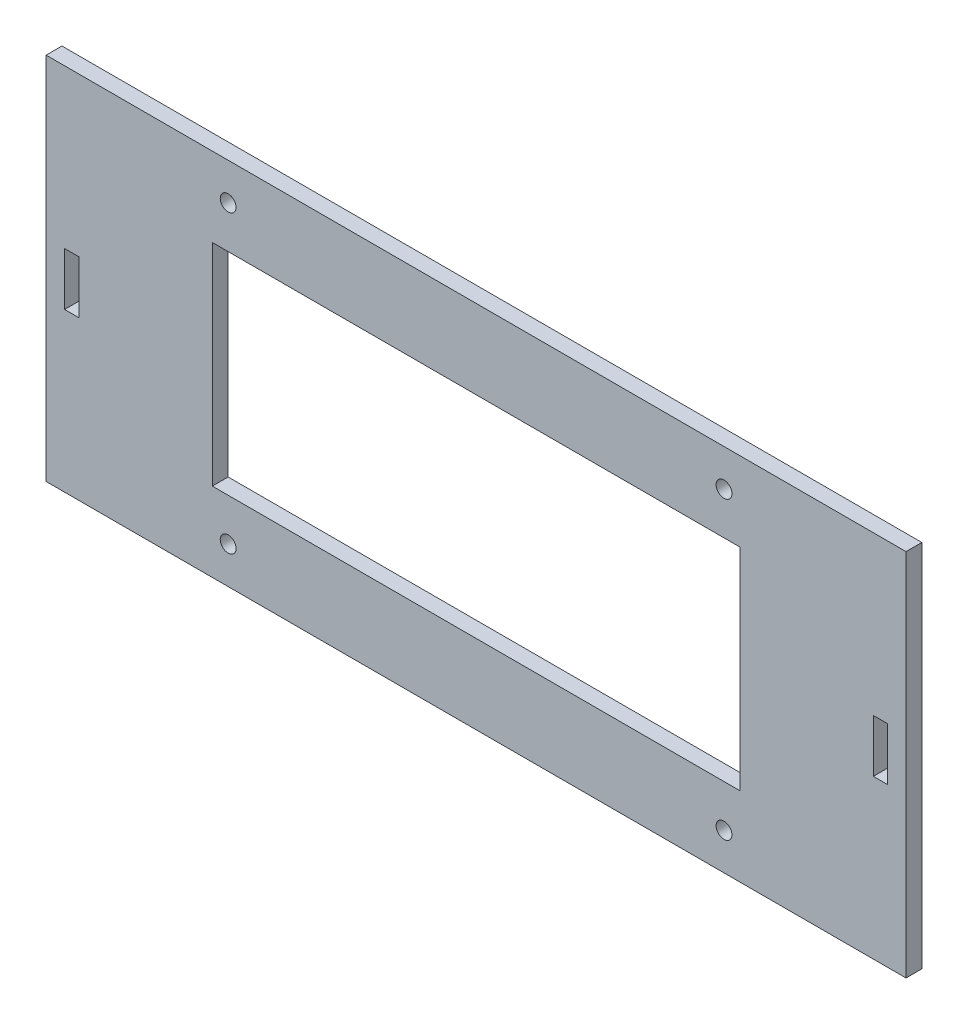
ISO-10303-21;
HEADER;
FILE_DESCRIPTION(('STEP AP214'),'2;1');
FILE_NAME('part.step','',(''),(''),'','','');
FILE_SCHEMA(('AUTOMOTIVE_DESIGN { 1 0 10303 214 1 1 1 1 }'));
ENDSEC;
DATA;
#1=APPLICATION_CONTEXT('core data for automotive mechanical design processes');
#2=APPLICATION_PROTOCOL_DEFINITION('international standard','automotive_design',2000,#1);
#3=PRODUCT_CONTEXT('',#1,'mechanical');
#4=PRODUCT('Part','Part','',(#3));
#5=PRODUCT_RELATED_PRODUCT_CATEGORY('part','',(#4));
#6=PRODUCT_DEFINITION_FORMATION('','',#4);
#7=PRODUCT_DEFINITION_CONTEXT('part definition',#1,'design');
#8=PRODUCT_DEFINITION('design','',#6,#7);
#9=PRODUCT_DEFINITION_SHAPE('','',#8);
#10=(LENGTH_UNIT() NAMED_UNIT(*) SI_UNIT(.MILLI.,.METRE.));
#11=(NAMED_UNIT(*) PLANE_ANGLE_UNIT() SI_UNIT($,.RADIAN.));
#12=(NAMED_UNIT(*) SI_UNIT($,.STERADIAN.) SOLID_ANGLE_UNIT());
#13=UNCERTAINTY_MEASURE_WITH_UNIT(LENGTH_MEASURE(1.E-05),#10,'distance_accuracy_value','');
#14=(GEOMETRIC_REPRESENTATION_CONTEXT(3) GLOBAL_UNCERTAINTY_ASSIGNED_CONTEXT((#13)) GLOBAL_UNIT_ASSIGNED_CONTEXT((#10,
#11,#12)) REPRESENTATION_CONTEXT('',''));
#15=CARTESIAN_POINT('',(0.,0.,0.));
#16=DIRECTION('',(0.,0.,1.));
#17=DIRECTION('',(1.,0.,0.));
#18=AXIS2_PLACEMENT_3D('',#15,#16,#17);
#19=CARTESIAN_POINT('',(0.,0.,3.));
#20=DIRECTION('',(0.,0.,-1.));
#21=DIRECTION('',(-1.,0.,0.));
#22=AXIS2_PLACEMENT_3D('',#19,#20,#21);
#23=PLANE('',#22);
#24=CARTESIAN_POINT('',(47.,-28.,3.));
#25=DIRECTION('',(0.,0.,-1.));
#26=DIRECTION('',(1.,0.,0.));
#27=AXIS2_PLACEMENT_3D('',#24,#25,#26);
#28=CIRCLE('',#27,1.5);
#29=CARTESIAN_POINT('',(48.5,-28.,3.));
#30=VERTEX_POINT('',#29);
#31=EDGE_CURVE('E482',#30,#30,#28,.T.);
#32=ORIENTED_EDGE('',*,*,#31,.T.);
#33=EDGE_LOOP('',(#32));
#34=FACE_BOUND('',#33,.T.);
#35=CARTESIAN_POINT('',(-47.,-28.,3.));
#36=DIRECTION('',(0.,0.,1.));
#37=DIRECTION('',(-1.,0.,0.));
#38=AXIS2_PLACEMENT_3D('',#35,#36,#37);
#39=CIRCLE('',#38,1.5);
#40=CARTESIAN_POINT('',(-48.5,-28.,3.));
#41=VERTEX_POINT('',#40);
#42=EDGE_CURVE('E487',#41,#41,#39,.T.);
#43=ORIENTED_EDGE('',*,*,#42,.F.);
#44=EDGE_LOOP('',(#43));
#45=FACE_BOUND('',#44,.T.);
#46=CARTESIAN_POINT('',(-47.,28.,3.));
#47=DIRECTION('',(0.,0.,-1.));
#48=DIRECTION('',(-1.,0.,0.));
#49=AXIS2_PLACEMENT_3D('',#46,#47,#48);
#50=CIRCLE('',#49,1.5);
#51=CARTESIAN_POINT('',(-48.5,28.,3.));
#52=VERTEX_POINT('',#51);
#53=EDGE_CURVE('E490',#52,#52,#50,.T.);
#54=ORIENTED_EDGE('',*,*,#53,.T.);
#55=EDGE_LOOP('',(#54));
#56=FACE_BOUND('',#55,.T.);
#57=CARTESIAN_POINT('',(47.,28.,3.));
#58=DIRECTION('',(0.,0.,1.));
#59=DIRECTION('',(1.,0.,0.));
#60=AXIS2_PLACEMENT_3D('',#57,#58,#59);
#61=CIRCLE('',#60,1.5);
#62=CARTESIAN_POINT('',(48.5,28.,3.));
#63=VERTEX_POINT('',#62);
#64=EDGE_CURVE('E499',#63,#63,#61,.T.);
#65=ORIENTED_EDGE('',*,*,#64,.F.);
#66=EDGE_LOOP('',(#65));
#67=FACE_BOUND('',#66,.T.);
#68=DIRECTION('',(1.,0.,0.));
#69=VECTOR('',#68,1.);
#70=CARTESIAN_POINT('',(50.,-20.,3.));
#71=LINE('',#70,#69);
#72=CARTESIAN_POINT('',(-50.,-20.,3.));
#73=VERTEX_POINT('',#72);
#74=CARTESIAN_POINT('',(50.,-20.,3.));
#75=VERTEX_POINT('',#74);
#76=EDGE_CURVE('E166',#73,#75,#71,.T.);
#77=ORIENTED_EDGE('',*,*,#76,.F.);
#78=DIRECTION('',(0.,-1.,0.));
#79=VECTOR('',#78,1.);
#80=CARTESIAN_POINT('',(-50.,20.,3.));
#81=LINE('',#80,#79);
#82=CARTESIAN_POINT('',(-50.,20.,3.));
#83=VERTEX_POINT('',#82);
#84=EDGE_CURVE('E50',#83,#73,#81,.T.);
#85=ORIENTED_EDGE('',*,*,#84,.F.);
#86=DIRECTION('',(-1.,0.,0.));
#87=VECTOR('',#86,1.);
#88=CARTESIAN_POINT('',(50.,20.,3.));
#89=LINE('',#88,#87);
#90=CARTESIAN_POINT('',(50.,20.,3.));
#91=VERTEX_POINT('',#90);
#92=EDGE_CURVE('E159',#91,#83,#89,.T.);
#93=ORIENTED_EDGE('',*,*,#92,.F.);
#94=DIRECTION('',(0.,1.,0.));
#95=VECTOR('',#94,1.);
#96=CARTESIAN_POINT('',(50.,20.,3.));
#97=LINE('',#96,#95);
#98=EDGE_CURVE('E173',#75,#91,#97,.T.);
#99=ORIENTED_EDGE('',*,*,#98,.F.);
#100=EDGE_LOOP('',(#77,#85,#93,#99));
#101=FACE_BOUND('',#100,.T.);
#102=DIRECTION('',(0.,-1.,0.));
#103=VECTOR('',#102,1.);
#104=CARTESIAN_POINT('',(81.5,35.,3.));
#105=LINE('',#104,#103);
#106=CARTESIAN_POINT('',(81.5,35.,3.));
#107=VERTEX_POINT('',#106);
#108=CARTESIAN_POINT('',(81.5,-35.,3.));
#109=VERTEX_POINT('',#108);
#110=EDGE_CURVE('E246',#107,#109,#105,.T.);
#111=ORIENTED_EDGE('',*,*,#110,.F.);
#112=DIRECTION('',(-1.,0.,0.));
#113=VECTOR('',#112,1.);
#114=CARTESIAN_POINT('',(81.5,35.,3.));
#115=LINE('',#114,#113);
#116=CARTESIAN_POINT('',(-81.5,35.,3.));
#117=VERTEX_POINT('',#116);
#118=EDGE_CURVE('E255',#107,#117,#115,.T.);
#119=ORIENTED_EDGE('',*,*,#118,.T.);
#120=DIRECTION('',(0.,-1.,0.));
#121=VECTOR('',#120,1.);
#122=CARTESIAN_POINT('',(-81.5,35.,3.));
#123=LINE('',#122,#121);
#124=CARTESIAN_POINT('',(-81.5,-35.,3.));
#125=VERTEX_POINT('',#124);
#126=EDGE_CURVE('E253',#117,#125,#123,.T.);
#127=ORIENTED_EDGE('',*,*,#126,.T.);
#128=DIRECTION('',(-1.,0.,0.));
#129=VECTOR('',#128,1.);
#130=CARTESIAN_POINT('',(81.5,-35.,3.));
#131=LINE('',#130,#129);
#132=EDGE_CURVE('E249',#109,#125,#131,.T.);
#133=ORIENTED_EDGE('',*,*,#132,.F.);
#134=EDGE_LOOP('',(#111,#119,#127,#133));
#135=FACE_BOUND('',#134,.T.);
#136=DIRECTION('',(1.,0.,0.));
#137=VECTOR('',#136,1.);
#138=CARTESIAN_POINT('',(-78.,-5.,3.));
#139=LINE('',#138,#137);
#140=CARTESIAN_POINT('',(-78.,-5.,3.));
#141=VERTEX_POINT('',#140);
#142=CARTESIAN_POINT('',(-75.3,-5.,3.));
#143=VERTEX_POINT('',#142);
#144=EDGE_CURVE('E224',#141,#143,#139,.T.);
#145=ORIENTED_EDGE('',*,*,#144,.F.);
#146=DIRECTION('',(0.,-1.,0.));
#147=VECTOR('',#146,1.);
#148=CARTESIAN_POINT('',(-78.,5.,3.));
#149=LINE('',#148,#147);
#150=CARTESIAN_POINT('',(-78.,5.,3.));
#151=VERTEX_POINT('',#150);
#152=EDGE_CURVE('E222',#151,#141,#149,.T.);
#153=ORIENTED_EDGE('',*,*,#152,.F.);
#154=DIRECTION('',(-1.,0.,0.));
#155=VECTOR('',#154,1.);
#156=CARTESIAN_POINT('',(-78.,5.,3.));
#157=LINE('',#156,#155);
#158=CARTESIAN_POINT('',(-75.3,5.,3.));
#159=VERTEX_POINT('',#158);
#160=EDGE_CURVE('E230',#159,#151,#157,.T.);
#161=ORIENTED_EDGE('',*,*,#160,.F.);
#162=DIRECTION('',(0.,1.,0.));
#163=VECTOR('',#162,1.);
#164=CARTESIAN_POINT('',(-75.3,5.,3.));
#165=LINE('',#164,#163);
#166=EDGE_CURVE('E227',#143,#159,#165,.T.);
#167=ORIENTED_EDGE('',*,*,#166,.F.);
#168=EDGE_LOOP('',(#145,#153,#161,#167));
#169=FACE_BOUND('',#168,.T.);
#170=DIRECTION('',(0.,-1.,0.));
#171=VECTOR('',#170,1.);
#172=CARTESIAN_POINT('',(78.,5.,3.));
#173=LINE('',#172,#171);
#174=CARTESIAN_POINT('',(78.,5.,3.));
#175=VERTEX_POINT('',#174);
#176=CARTESIAN_POINT('',(78.,-5.,3.));
#177=VERTEX_POINT('',#176);
#178=EDGE_CURVE('E189',#175,#177,#173,.T.);
#179=ORIENTED_EDGE('',*,*,#178,.T.);
#180=DIRECTION('',(-1.,0.,0.));
#181=VECTOR('',#180,1.);
#182=CARTESIAN_POINT('',(78.,-5.,3.));
#183=LINE('',#182,#181);
#184=CARTESIAN_POINT('',(75.3,-5.,3.));
#185=VERTEX_POINT('',#184);
#186=EDGE_CURVE('E198',#177,#185,#183,.T.);
#187=ORIENTED_EDGE('',*,*,#186,.T.);
#188=DIRECTION('',(0.,1.,0.));
#189=VECTOR('',#188,1.);
#190=CARTESIAN_POINT('',(75.3,5.,3.));
#191=LINE('',#190,#189);
#192=CARTESIAN_POINT('',(75.3,5.,3.));
#193=VERTEX_POINT('',#192);
#194=EDGE_CURVE('E195',#185,#193,#191,.T.);
#195=ORIENTED_EDGE('',*,*,#194,.T.);
#196=DIRECTION('',(1.,0.,0.));
#197=VECTOR('',#196,1.);
#198=CARTESIAN_POINT('',(78.,5.,3.));
#199=LINE('',#198,#197);
#200=EDGE_CURVE('E192',#193,#175,#199,.T.);
#201=ORIENTED_EDGE('',*,*,#200,.T.);
#202=EDGE_LOOP('',(#179,#187,#195,#201));
#203=FACE_BOUND('',#202,.T.);
#204=ADVANCED_FACE('F33',(#34,#45,#56,#67,#101,#135,#169,#203),#23,.F.);
#205=CARTESIAN_POINT('',(0.,0.,0.));
#206=DIRECTION('',(0.,0.,-1.));
#207=DIRECTION('',(-1.,0.,0.));
#208=AXIS2_PLACEMENT_3D('',#205,#206,#207);
#209=PLANE('',#208);
#210=CARTESIAN_POINT('',(47.,-28.,0.));
#211=DIRECTION('',(0.,0.,-1.));
#212=DIRECTION('',(-1.,0.,0.));
#213=AXIS2_PLACEMENT_3D('',#210,#211,#212);
#214=CIRCLE('',#213,1.5);
#215=CARTESIAN_POINT('',(45.5,-28.,0.));
#216=VERTEX_POINT('',#215);
#217=EDGE_CURVE('E479',#216,#216,#214,.T.);
#218=ORIENTED_EDGE('',*,*,#217,.F.);
#219=EDGE_LOOP('',(#218));
#220=FACE_BOUND('',#219,.T.);
#221=CARTESIAN_POINT('',(-47.,-28.,0.));
#222=DIRECTION('',(0.,0.,-1.));
#223=DIRECTION('',(-1.,0.,0.));
#224=AXIS2_PLACEMENT_3D('',#221,#222,#223);
#225=CIRCLE('',#224,1.5);
#226=CARTESIAN_POINT('',(-48.5,-28.,0.));
#227=VERTEX_POINT('',#226);
#228=EDGE_CURVE('E484',#227,#227,#225,.F.);
#229=ORIENTED_EDGE('',*,*,#228,.T.);
#230=EDGE_LOOP('',(#229));
#231=FACE_BOUND('',#230,.T.);
#232=CARTESIAN_POINT('',(-47.,28.,0.));
#233=DIRECTION('',(0.,0.,-1.));
#234=DIRECTION('',(-1.,0.,0.));
#235=AXIS2_PLACEMENT_3D('',#232,#233,#234);
#236=CIRCLE('',#235,1.5);
#237=CARTESIAN_POINT('',(-48.5,28.,0.));
#238=VERTEX_POINT('',#237);
#239=EDGE_CURVE('E495',#238,#238,#236,.T.);
#240=ORIENTED_EDGE('',*,*,#239,.F.);
#241=EDGE_LOOP('',(#240));
#242=FACE_BOUND('',#241,.T.);
#243=CARTESIAN_POINT('',(47.,28.,0.));
#244=DIRECTION('',(0.,0.,-1.));
#245=DIRECTION('',(-1.,0.,0.));
#246=AXIS2_PLACEMENT_3D('',#243,#244,#245);
#247=CIRCLE('',#246,1.5);
#248=CARTESIAN_POINT('',(45.5,28.,0.));
#249=VERTEX_POINT('',#248);
#250=EDGE_CURVE('E498',#249,#249,#247,.F.);
#251=ORIENTED_EDGE('',*,*,#250,.T.);
#252=EDGE_LOOP('',(#251));
#253=FACE_BOUND('',#252,.T.);
#254=DIRECTION('',(0.,-1.,0.));
#255=VECTOR('',#254,1.);
#256=CARTESIAN_POINT('',(-50.,20.,0.));
#257=LINE('',#256,#255);
#258=CARTESIAN_POINT('',(-50.,20.,0.));
#259=VERTEX_POINT('',#258);
#260=CARTESIAN_POINT('',(-50.,-20.,0.));
#261=VERTEX_POINT('',#260);
#262=EDGE_CURVE('E157',#259,#261,#257,.T.);
#263=ORIENTED_EDGE('',*,*,#262,.T.);
#264=DIRECTION('',(1.,0.,0.));
#265=VECTOR('',#264,1.);
#266=CARTESIAN_POINT('',(50.,-20.,0.));
#267=LINE('',#266,#265);
#268=CARTESIAN_POINT('',(50.,-20.,0.));
#269=VERTEX_POINT('',#268);
#270=EDGE_CURVE('E146',#261,#269,#267,.T.);
#271=ORIENTED_EDGE('',*,*,#270,.T.);
#272=DIRECTION('',(0.,1.,0.));
#273=VECTOR('',#272,1.);
#274=CARTESIAN_POINT('',(50.,20.,0.));
#275=LINE('',#274,#273);
#276=CARTESIAN_POINT('',(50.,20.,0.));
#277=VERTEX_POINT('',#276);
#278=EDGE_CURVE('E168',#269,#277,#275,.T.);
#279=ORIENTED_EDGE('',*,*,#278,.T.);
#280=DIRECTION('',(-1.,0.,0.));
#281=VECTOR('',#280,1.);
#282=CARTESIAN_POINT('',(50.,20.,0.));
#283=LINE('',#282,#281);
#284=EDGE_CURVE('E164',#277,#259,#283,.T.);
#285=ORIENTED_EDGE('',*,*,#284,.T.);
#286=EDGE_LOOP('',(#263,#271,#279,#285));
#287=FACE_BOUND('',#286,.T.);
#288=DIRECTION('',(0.,-1.,0.));
#289=VECTOR('',#288,1.);
#290=CARTESIAN_POINT('',(-78.,5.,0.));
#291=LINE('',#290,#289);
#292=CARTESIAN_POINT('',(-78.,5.,0.));
#293=VERTEX_POINT('',#292);
#294=CARTESIAN_POINT('',(-78.,-5.,0.));
#295=VERTEX_POINT('',#294);
#296=EDGE_CURVE('E219',#293,#295,#291,.T.);
#297=ORIENTED_EDGE('',*,*,#296,.T.);
#298=DIRECTION('',(1.,0.,0.));
#299=VECTOR('',#298,1.);
#300=CARTESIAN_POINT('',(-78.,-5.,0.));
#301=LINE('',#300,#299);
#302=CARTESIAN_POINT('',(-75.3,-5.,0.));
#303=VERTEX_POINT('',#302);
#304=EDGE_CURVE('E236',#295,#303,#301,.T.);
#305=ORIENTED_EDGE('',*,*,#304,.T.);
#306=DIRECTION('',(0.,1.,0.));
#307=VECTOR('',#306,1.);
#308=CARTESIAN_POINT('',(-75.3,5.,0.));
#309=LINE('',#308,#307);
#310=CARTESIAN_POINT('',(-75.3,5.,0.));
#311=VERTEX_POINT('',#310);
#312=EDGE_CURVE('E213',#303,#311,#309,.T.);
#313=ORIENTED_EDGE('',*,*,#312,.T.);
#314=DIRECTION('',(-1.,0.,0.));
#315=VECTOR('',#314,1.);
#316=CARTESIAN_POINT('',(-78.,5.,0.));
#317=LINE('',#316,#315);
#318=EDGE_CURVE('E216',#311,#293,#317,.T.);
#319=ORIENTED_EDGE('',*,*,#318,.T.);
#320=EDGE_LOOP('',(#297,#305,#313,#319));
#321=FACE_BOUND('',#320,.T.);
#322=DIRECTION('',(0.,-1.,0.));
#323=VECTOR('',#322,1.);
#324=CARTESIAN_POINT('',(81.5,35.,0.));
#325=LINE('',#324,#323);
#326=CARTESIAN_POINT('',(81.5,35.,0.));
#327=VERTEX_POINT('',#326);
#328=CARTESIAN_POINT('',(81.5,-35.,0.));
#329=VERTEX_POINT('',#328);
#330=EDGE_CURVE('E245',#327,#329,#325,.T.);
#331=ORIENTED_EDGE('',*,*,#330,.T.);
#332=DIRECTION('',(-1.,0.,0.));
#333=VECTOR('',#332,1.);
#334=CARTESIAN_POINT('',(81.5,-35.,0.));
#335=LINE('',#334,#333);
#336=CARTESIAN_POINT('',(-81.5,-35.,0.));
#337=VERTEX_POINT('',#336);
#338=EDGE_CURVE('E259',#329,#337,#335,.T.);
#339=ORIENTED_EDGE('',*,*,#338,.T.);
#340=DIRECTION('',(0.,-1.,0.));
#341=VECTOR('',#340,1.);
#342=CARTESIAN_POINT('',(-81.5,35.,0.));
#343=LINE('',#342,#341);
#344=CARTESIAN_POINT('',(-81.5,35.,0.));
#345=VERTEX_POINT('',#344);
#346=EDGE_CURVE('E262',#345,#337,#343,.T.);
#347=ORIENTED_EDGE('',*,*,#346,.F.);
#348=DIRECTION('',(-1.,0.,0.));
#349=VECTOR('',#348,1.);
#350=CARTESIAN_POINT('',(81.5,35.,0.));
#351=LINE('',#350,#349);
#352=EDGE_CURVE('E250',#327,#345,#351,.T.);
#353=ORIENTED_EDGE('',*,*,#352,.F.);
#354=EDGE_LOOP('',(#331,#339,#347,#353));
#355=FACE_BOUND('',#354,.T.);
#356=DIRECTION('',(-1.,0.,0.));
#357=VECTOR('',#356,1.);
#358=CARTESIAN_POINT('',(78.,-5.,0.));
#359=LINE('',#358,#357);
#360=CARTESIAN_POINT('',(78.,-5.,0.));
#361=VERTEX_POINT('',#360);
#362=CARTESIAN_POINT('',(75.3,-5.,0.));
#363=VERTEX_POINT('',#362);
#364=EDGE_CURVE('E183',#361,#363,#359,.T.);
#365=ORIENTED_EDGE('',*,*,#364,.F.);
#366=DIRECTION('',(0.,-1.,0.));
#367=VECTOR('',#366,1.);
#368=CARTESIAN_POINT('',(78.,5.,0.));
#369=LINE('',#368,#367);
#370=CARTESIAN_POINT('',(78.,5.,0.));
#371=VERTEX_POINT('',#370);
#372=EDGE_CURVE('E186',#371,#361,#369,.T.);
#373=ORIENTED_EDGE('',*,*,#372,.F.);
#374=DIRECTION('',(1.,0.,0.));
#375=VECTOR('',#374,1.);
#376=CARTESIAN_POINT('',(78.,5.,0.));
#377=LINE('',#376,#375);
#378=CARTESIAN_POINT('',(75.3,5.,0.));
#379=VERTEX_POINT('',#378);
#380=EDGE_CURVE('E204',#379,#371,#377,.T.);
#381=ORIENTED_EDGE('',*,*,#380,.F.);
#382=DIRECTION('',(0.,1.,0.));
#383=VECTOR('',#382,1.);
#384=CARTESIAN_POINT('',(75.3,5.,0.));
#385=LINE('',#384,#383);
#386=EDGE_CURVE('E153',#363,#379,#385,.T.);
#387=ORIENTED_EDGE('',*,*,#386,.F.);
#388=EDGE_LOOP('',(#365,#373,#381,#387));
#389=FACE_BOUND('',#388,.T.);
#390=ADVANCED_FACE('F162',(#220,#231,#242,#253,#287,#321,#355,#389),#209,.T.);
#391=CARTESIAN_POINT('',(81.5,35.,3.));
#392=DIRECTION('',(1.,0.,0.));
#393=DIRECTION('',(0.,0.,-1.));
#394=AXIS2_PLACEMENT_3D('',#391,#392,#393);
#395=PLANE('',#394);
#396=ORIENTED_EDGE('',*,*,#330,.F.);
#397=DIRECTION('',(0.,0.,-1.));
#398=VECTOR('',#397,1.);
#399=CARTESIAN_POINT('',(81.5,35.,3.));
#400=LINE('',#399,#398);
#401=EDGE_CURVE('E11',#107,#327,#400,.T.);
#402=ORIENTED_EDGE('',*,*,#401,.F.);
#403=ORIENTED_EDGE('',*,*,#110,.T.);
#404=DIRECTION('',(0.,0.,-1.));
#405=VECTOR('',#404,1.);
#406=CARTESIAN_POINT('',(81.5,-35.,3.));
#407=LINE('',#406,#405);
#408=EDGE_CURVE('E37',#109,#329,#407,.T.);
#409=ORIENTED_EDGE('',*,*,#408,.T.);
#410=EDGE_LOOP('',(#396,#402,#403,#409));
#411=FACE_BOUND('',#410,.T.);
#412=ADVANCED_FACE('F35',(#411),#395,.T.);
#413=CARTESIAN_POINT('',(81.5,35.,3.));
#414=DIRECTION('',(0.,-1.,0.));
#415=DIRECTION('',(1.,0.,0.));
#416=AXIS2_PLACEMENT_3D('',#413,#414,#415);
#417=PLANE('',#416);
#418=ORIENTED_EDGE('',*,*,#352,.T.);
#419=DIRECTION('',(0.,0.,-1.));
#420=VECTOR('',#419,1.);
#421=CARTESIAN_POINT('',(-81.5,35.,3.));
#422=LINE('',#421,#420);
#423=EDGE_CURVE('E42',#117,#345,#422,.T.);
#424=ORIENTED_EDGE('',*,*,#423,.F.);
#425=ORIENTED_EDGE('',*,*,#118,.F.);
#426=ORIENTED_EDGE('',*,*,#401,.T.);
#427=EDGE_LOOP('',(#418,#424,#425,#426));
#428=FACE_BOUND('',#427,.T.);
#429=ADVANCED_FACE('F282',(#428),#417,.F.);
#430=CARTESIAN_POINT('',(-81.5,35.,3.));
#431=DIRECTION('',(1.,0.,0.));
#432=DIRECTION('',(0.,1.,0.));
#433=AXIS2_PLACEMENT_3D('',#430,#431,#432);
#434=PLANE('',#433);
#435=ORIENTED_EDGE('',*,*,#346,.T.);
#436=DIRECTION('',(0.,0.,-1.));
#437=VECTOR('',#436,1.);
#438=CARTESIAN_POINT('',(-81.5,-35.,3.));
#439=LINE('',#438,#437);
#440=EDGE_CURVE('E267',#125,#337,#439,.T.);
#441=ORIENTED_EDGE('',*,*,#440,.F.);
#442=ORIENTED_EDGE('',*,*,#126,.F.);
#443=ORIENTED_EDGE('',*,*,#423,.T.);
#444=EDGE_LOOP('',(#435,#441,#442,#443));
#445=FACE_BOUND('',#444,.T.);
#446=ADVANCED_FACE('F286',(#445),#434,.F.);
#447=CARTESIAN_POINT('',(81.5,-35.,3.));
#448=DIRECTION('',(0.,-1.,0.));
#449=DIRECTION('',(1.,0.,0.));
#450=AXIS2_PLACEMENT_3D('',#447,#448,#449);
#451=PLANE('',#450);
#452=ORIENTED_EDGE('',*,*,#338,.F.);
#453=ORIENTED_EDGE('',*,*,#408,.F.);
#454=ORIENTED_EDGE('',*,*,#132,.T.);
#455=ORIENTED_EDGE('',*,*,#440,.T.);
#456=EDGE_LOOP('',(#452,#453,#454,#455));
#457=FACE_BOUND('',#456,.T.);
#458=ADVANCED_FACE('F275',(#457),#451,.T.);
#459=CARTESIAN_POINT('',(-78.,5.,-0.00100000000000013));
#460=DIRECTION('',(-1.,0.,0.));
#461=DIRECTION('',(0.,0.,1.));
#462=AXIS2_PLACEMENT_3D('',#459,#460,#461);
#463=PLANE('',#462);
#464=DIRECTION('',(0.,0.,1.));
#465=VECTOR('',#464,1.);
#466=CARTESIAN_POINT('',(-78.,5.,-0.00100000000000013));
#467=LINE('',#466,#465);
#468=EDGE_CURVE('E234',#293,#151,#467,.T.);
#469=ORIENTED_EDGE('',*,*,#468,.T.);
#470=ORIENTED_EDGE('',*,*,#152,.T.);
#471=DIRECTION('',(0.,0.,1.));
#472=VECTOR('',#471,1.);
#473=CARTESIAN_POINT('',(-78.,-5.,-0.00100000000000013));
#474=LINE('',#473,#472);
#475=EDGE_CURVE('E233',#295,#141,#474,.T.);
#476=ORIENTED_EDGE('',*,*,#475,.F.);
#477=ORIENTED_EDGE('',*,*,#296,.F.);
#478=EDGE_LOOP('',(#469,#470,#476,#477));
#479=FACE_BOUND('',#478,.T.);
#480=ADVANCED_FACE('F329',(#479),#463,.F.);
#481=CARTESIAN_POINT('',(-78.,5.,-0.00100000000000013));
#482=DIRECTION('',(0.,1.,0.));
#483=DIRECTION('',(0.,0.,1.));
#484=AXIS2_PLACEMENT_3D('',#481,#482,#483);
#485=PLANE('',#484);
#486=DIRECTION('',(0.,0.,1.));
#487=VECTOR('',#486,1.);
#488=CARTESIAN_POINT('',(-75.3,5.,-0.00100000000000013));
#489=LINE('',#488,#487);
#490=EDGE_CURVE('E237',#311,#159,#489,.T.);
#491=ORIENTED_EDGE('',*,*,#490,.T.);
#492=ORIENTED_EDGE('',*,*,#160,.T.);
#493=ORIENTED_EDGE('',*,*,#468,.F.);
#494=ORIENTED_EDGE('',*,*,#318,.F.);
#495=EDGE_LOOP('',(#491,#492,#493,#494));
#496=FACE_BOUND('',#495,.T.);
#497=ADVANCED_FACE('F325',(#496),#485,.F.);
#498=CARTESIAN_POINT('',(-75.3,5.,-0.00100000000000013));
#499=DIRECTION('',(1.,0.,0.));
#500=DIRECTION('',(0.,0.,-1.));
#501=AXIS2_PLACEMENT_3D('',#498,#499,#500);
#502=PLANE('',#501);
#503=DIRECTION('',(0.,0.,1.));
#504=VECTOR('',#503,1.);
#505=CARTESIAN_POINT('',(-75.3,-5.,-0.00100000000000013));
#506=LINE('',#505,#504);
#507=EDGE_CURVE('E239',#303,#143,#506,.T.);
#508=ORIENTED_EDGE('',*,*,#507,.T.);
#509=ORIENTED_EDGE('',*,*,#166,.T.);
#510=ORIENTED_EDGE('',*,*,#490,.F.);
#511=ORIENTED_EDGE('',*,*,#312,.F.);
#512=EDGE_LOOP('',(#508,#509,#510,#511));
#513=FACE_BOUND('',#512,.T.);
#514=ADVANCED_FACE('F328',(#513),#502,.F.);
#515=CARTESIAN_POINT('',(-78.,-5.,-0.00100000000000013));
#516=DIRECTION('',(0.,-1.,0.));
#517=DIRECTION('',(0.,0.,-1.));
#518=AXIS2_PLACEMENT_3D('',#515,#516,#517);
#519=PLANE('',#518);
#520=ORIENTED_EDGE('',*,*,#475,.T.);
#521=ORIENTED_EDGE('',*,*,#144,.T.);
#522=ORIENTED_EDGE('',*,*,#507,.F.);
#523=ORIENTED_EDGE('',*,*,#304,.F.);
#524=EDGE_LOOP('',(#520,#521,#522,#523));
#525=FACE_BOUND('',#524,.T.);
#526=ADVANCED_FACE('F324',(#525),#519,.F.);
#527=CARTESIAN_POINT('',(78.,5.,-0.00100000000000013));
#528=DIRECTION('',(-1.,0.,0.));
#529=DIRECTION('',(0.,0.,1.));
#530=AXIS2_PLACEMENT_3D('',#527,#528,#529);
#531=PLANE('',#530);
#532=ORIENTED_EDGE('',*,*,#372,.T.);
#533=DIRECTION('',(0.,0.,1.));
#534=VECTOR('',#533,1.);
#535=CARTESIAN_POINT('',(78.,-5.,-0.00100000000000013));
#536=LINE('',#535,#534);
#537=EDGE_CURVE('E202',#361,#177,#536,.T.);
#538=ORIENTED_EDGE('',*,*,#537,.T.);
#539=ORIENTED_EDGE('',*,*,#178,.F.);
#540=DIRECTION('',(0.,0.,1.));
#541=VECTOR('',#540,1.);
#542=CARTESIAN_POINT('',(78.,5.,-0.00100000000000013));
#543=LINE('',#542,#541);
#544=EDGE_CURVE('E201',#371,#175,#543,.T.);
#545=ORIENTED_EDGE('',*,*,#544,.F.);
#546=EDGE_LOOP('',(#532,#538,#539,#545));
#547=FACE_BOUND('',#546,.T.);
#548=ADVANCED_FACE('F299',(#547),#531,.T.);
#549=CARTESIAN_POINT('',(78.,-5.,-0.00100000000000013));
#550=DIRECTION('',(0.,1.,0.));
#551=DIRECTION('',(0.,0.,1.));
#552=AXIS2_PLACEMENT_3D('',#549,#550,#551);
#553=PLANE('',#552);
#554=ORIENTED_EDGE('',*,*,#364,.T.);
#555=DIRECTION('',(0.,0.,1.));
#556=VECTOR('',#555,1.);
#557=CARTESIAN_POINT('',(75.3,-5.,-0.00100000000000013));
#558=LINE('',#557,#556);
#559=EDGE_CURVE('E205',#363,#185,#558,.T.);
#560=ORIENTED_EDGE('',*,*,#559,.T.);
#561=ORIENTED_EDGE('',*,*,#186,.F.);
#562=ORIENTED_EDGE('',*,*,#537,.F.);
#563=EDGE_LOOP('',(#554,#560,#561,#562));
#564=FACE_BOUND('',#563,.T.);
#565=ADVANCED_FACE('F308',(#564),#553,.T.);
#566=CARTESIAN_POINT('',(75.3,5.,-0.00100000000000013));
#567=DIRECTION('',(1.,0.,0.));
#568=DIRECTION('',(0.,0.,-1.));
#569=AXIS2_PLACEMENT_3D('',#566,#567,#568);
#570=PLANE('',#569);
#571=ORIENTED_EDGE('',*,*,#386,.T.);
#572=DIRECTION('',(0.,0.,1.));
#573=VECTOR('',#572,1.);
#574=CARTESIAN_POINT('',(75.3,5.,-0.00100000000000013));
#575=LINE('',#574,#573);
#576=EDGE_CURVE('E207',#379,#193,#575,.T.);
#577=ORIENTED_EDGE('',*,*,#576,.T.);
#578=ORIENTED_EDGE('',*,*,#194,.F.);
#579=ORIENTED_EDGE('',*,*,#559,.F.);
#580=EDGE_LOOP('',(#571,#577,#578,#579));
#581=FACE_BOUND('',#580,.T.);
#582=ADVANCED_FACE('F311',(#581),#570,.T.);
#583=CARTESIAN_POINT('',(78.,5.,-0.00100000000000013));
#584=DIRECTION('',(0.,-1.,0.));
#585=DIRECTION('',(0.,0.,-1.));
#586=AXIS2_PLACEMENT_3D('',#583,#584,#585);
#587=PLANE('',#586);
#588=ORIENTED_EDGE('',*,*,#380,.T.);
#589=ORIENTED_EDGE('',*,*,#544,.T.);
#590=ORIENTED_EDGE('',*,*,#200,.F.);
#591=ORIENTED_EDGE('',*,*,#576,.F.);
#592=EDGE_LOOP('',(#588,#589,#590,#591));
#593=FACE_BOUND('',#592,.T.);
#594=ADVANCED_FACE('F301',(#593),#587,.T.);
#595=CARTESIAN_POINT('',(-50.,20.,-0.00100000000000013));
#596=DIRECTION('',(-1.,0.,0.));
#597=DIRECTION('',(0.,-1.,0.));
#598=AXIS2_PLACEMENT_3D('',#595,#596,#597);
#599=PLANE('',#598);
#600=DIRECTION('',(0.,0.,1.));
#601=VECTOR('',#600,1.);
#602=CARTESIAN_POINT('',(-50.,20.,-0.00100000000000013));
#603=LINE('',#602,#601);
#604=EDGE_CURVE('E154',#259,#83,#603,.T.);
#605=ORIENTED_EDGE('',*,*,#604,.T.);
#606=ORIENTED_EDGE('',*,*,#84,.T.);
#607=DIRECTION('',(0.,0.,1.));
#608=VECTOR('',#607,1.);
#609=CARTESIAN_POINT('',(-50.,-20.,-0.00100000000000013));
#610=LINE('',#609,#608);
#611=EDGE_CURVE('E148',#261,#73,#610,.T.);
#612=ORIENTED_EDGE('',*,*,#611,.F.);
#613=ORIENTED_EDGE('',*,*,#262,.F.);
#614=EDGE_LOOP('',(#605,#606,#612,#613));
#615=FACE_BOUND('',#614,.T.);
#616=ADVANCED_FACE('F156',(#615),#599,.F.);
#617=CARTESIAN_POINT('',(50.,20.,-0.00100000000000013));
#618=DIRECTION('',(0.,1.,0.));
#619=DIRECTION('',(-1.,0.,0.));
#620=AXIS2_PLACEMENT_3D('',#617,#618,#619);
#621=PLANE('',#620);
#622=DIRECTION('',(0.,0.,1.));
#623=VECTOR('',#622,1.);
#624=CARTESIAN_POINT('',(50.,20.,-0.00100000000000013));
#625=LINE('',#624,#623);
#626=EDGE_CURVE('E179',#277,#91,#625,.T.);
#627=ORIENTED_EDGE('',*,*,#626,.T.);
#628=ORIENTED_EDGE('',*,*,#92,.T.);
#629=ORIENTED_EDGE('',*,*,#604,.F.);
#630=ORIENTED_EDGE('',*,*,#284,.F.);
#631=EDGE_LOOP('',(#627,#628,#629,#630));
#632=FACE_BOUND('',#631,.T.);
#633=ADVANCED_FACE('F404',(#632),#621,.F.);
#634=CARTESIAN_POINT('',(50.,20.,-0.00100000000000013));
#635=DIRECTION('',(1.,0.,0.));
#636=DIRECTION('',(0.,1.,0.));
#637=AXIS2_PLACEMENT_3D('',#634,#635,#636);
#638=PLANE('',#637);
#639=DIRECTION('',(0.,0.,1.));
#640=VECTOR('',#639,1.);
#641=CARTESIAN_POINT('',(50.,-20.,-0.00100000000000013));
#642=LINE('',#641,#640);
#643=EDGE_CURVE('E58',#269,#75,#642,.T.);
#644=ORIENTED_EDGE('',*,*,#643,.T.);
#645=ORIENTED_EDGE('',*,*,#98,.T.);
#646=ORIENTED_EDGE('',*,*,#626,.F.);
#647=ORIENTED_EDGE('',*,*,#278,.F.);
#648=EDGE_LOOP('',(#644,#645,#646,#647));
#649=FACE_BOUND('',#648,.T.);
#650=ADVANCED_FACE('F412',(#649),#638,.F.);
#651=CARTESIAN_POINT('',(50.,-20.,-0.00100000000000013));
#652=DIRECTION('',(0.,-1.,0.));
#653=DIRECTION('',(1.,0.,0.));
#654=AXIS2_PLACEMENT_3D('',#651,#652,#653);
#655=PLANE('',#654);
#656=ORIENTED_EDGE('',*,*,#611,.T.);
#657=ORIENTED_EDGE('',*,*,#76,.T.);
#658=ORIENTED_EDGE('',*,*,#643,.F.);
#659=ORIENTED_EDGE('',*,*,#270,.F.);
#660=EDGE_LOOP('',(#656,#657,#658,#659));
#661=FACE_BOUND('',#660,.T.);
#662=ADVANCED_FACE('F147',(#661),#655,.F.);
#663=CARTESIAN_POINT('',(47.,28.,-0.00100000000000013));
#664=DIRECTION('',(0.,0.,1.));
#665=DIRECTION('',(1.,0.,0.));
#666=AXIS2_PLACEMENT_3D('',#663,#664,#665);
#667=CYLINDRICAL_SURFACE('',#666,1.5);
#668=ORIENTED_EDGE('',*,*,#250,.F.);
#669=EDGE_LOOP('',(#668));
#670=FACE_BOUND('',#669,.T.);
#671=ORIENTED_EDGE('',*,*,#64,.T.);
#672=EDGE_LOOP('',(#671));
#673=FACE_BOUND('',#672,.T.);
#674=ADVANCED_FACE('F431',(#670,#673),#667,.F.);
#675=CARTESIAN_POINT('',(-47.,28.,-0.00100000000000013));
#676=DIRECTION('',(0.,0.,1.));
#677=DIRECTION('',(1.,0.,0.));
#678=AXIS2_PLACEMENT_3D('',#675,#676,#677);
#679=CYLINDRICAL_SURFACE('',#678,1.5);
#680=ORIENTED_EDGE('',*,*,#239,.T.);
#681=EDGE_LOOP('',(#680));
#682=FACE_BOUND('',#681,.T.);
#683=ORIENTED_EDGE('',*,*,#53,.F.);
#684=EDGE_LOOP('',(#683));
#685=FACE_BOUND('',#684,.T.);
#686=ADVANCED_FACE('F440',(#682,#685),#679,.F.);
#687=CARTESIAN_POINT('',(-47.,-28.,-0.00100000000000013));
#688=DIRECTION('',(0.,0.,1.));
#689=DIRECTION('',(1.,0.,0.));
#690=AXIS2_PLACEMENT_3D('',#687,#688,#689);
#691=CYLINDRICAL_SURFACE('',#690,1.5);
#692=ORIENTED_EDGE('',*,*,#228,.F.);
#693=EDGE_LOOP('',(#692));
#694=FACE_BOUND('',#693,.T.);
#695=ORIENTED_EDGE('',*,*,#42,.T.);
#696=EDGE_LOOP('',(#695));
#697=FACE_BOUND('',#696,.T.);
#698=ADVANCED_FACE('F449',(#694,#697),#691,.F.);
#699=CARTESIAN_POINT('',(47.,-28.,-0.00100000000000013));
#700=DIRECTION('',(0.,0.,1.));
#701=DIRECTION('',(1.,0.,0.));
#702=AXIS2_PLACEMENT_3D('',#699,#700,#701);
#703=CYLINDRICAL_SURFACE('',#702,1.5);
#704=ORIENTED_EDGE('',*,*,#217,.T.);
#705=EDGE_LOOP('',(#704));
#706=FACE_BOUND('',#705,.T.);
#707=ORIENTED_EDGE('',*,*,#31,.F.);
#708=EDGE_LOOP('',(#707));
#709=FACE_BOUND('',#708,.T.);
#710=ADVANCED_FACE('F462',(#706,#709),#703,.F.);
#711=CLOSED_SHELL('',(#204,#390,#412,#429,#446,#458,#480,#497,#514,#526,#548,#565,#582,#594,
#616,#633,#650,#662,#674,#686,#698,#710));
#712=MANIFOLD_SOLID_BREP('B2',#711);
#713=ADVANCED_BREP_SHAPE_REPRESENTATION('',(#18,#712),#14);
#714=SHAPE_DEFINITION_REPRESENTATION(#9,#713);
ENDSEC;
END-ISO-10303-21;
